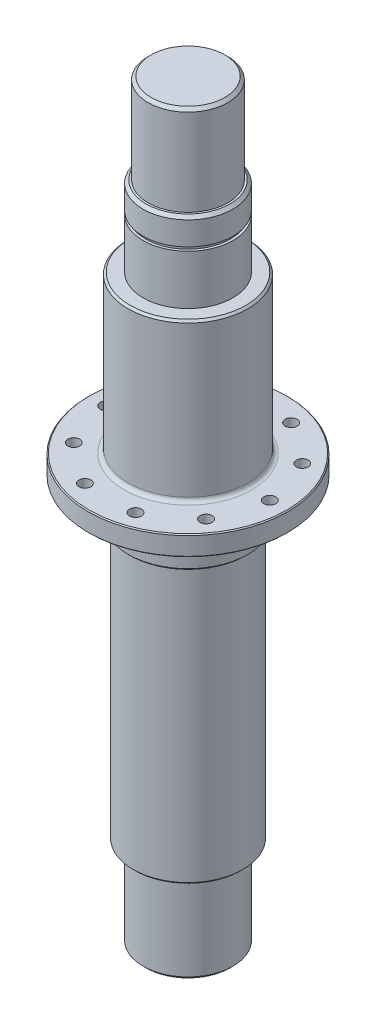
ISO-10303-21;
HEADER;
FILE_DESCRIPTION(('STEP AP214'),'2;1');
FILE_NAME('part.step','',(''),(''),'','','');
FILE_SCHEMA(('AUTOMOTIVE_DESIGN { 1 0 10303 214 1 1 1 1 }'));
ENDSEC;
DATA;
#1=APPLICATION_CONTEXT('core data for automotive mechanical design processes');
#2=APPLICATION_PROTOCOL_DEFINITION('international standard','automotive_design',2000,#1);
#3=PRODUCT_CONTEXT('',#1,'mechanical');
#4=PRODUCT('Part','Part','',(#3));
#5=PRODUCT_RELATED_PRODUCT_CATEGORY('part','',(#4));
#6=PRODUCT_DEFINITION_FORMATION('','',#4);
#7=PRODUCT_DEFINITION_CONTEXT('part definition',#1,'design');
#8=PRODUCT_DEFINITION('design','',#6,#7);
#9=PRODUCT_DEFINITION_SHAPE('','',#8);
#10=(LENGTH_UNIT() NAMED_UNIT(*) SI_UNIT(.MILLI.,.METRE.));
#11=(NAMED_UNIT(*) PLANE_ANGLE_UNIT() SI_UNIT($,.RADIAN.));
#12=(NAMED_UNIT(*) SI_UNIT($,.STERADIAN.) SOLID_ANGLE_UNIT());
#13=UNCERTAINTY_MEASURE_WITH_UNIT(LENGTH_MEASURE(1.E-05),#10,'distance_accuracy_value','');
#14=(GEOMETRIC_REPRESENTATION_CONTEXT(3) GLOBAL_UNCERTAINTY_ASSIGNED_CONTEXT((#13)) GLOBAL_UNIT_ASSIGNED_CONTEXT((#10,
#11,#12)) REPRESENTATION_CONTEXT('',''));
#15=CARTESIAN_POINT('',(0.,0.,0.));
#16=DIRECTION('',(0.,0.,1.));
#17=DIRECTION('',(1.,0.,0.));
#18=AXIS2_PLACEMENT_3D('',#15,#16,#17);
#19=CARTESIAN_POINT('',(0.,-158.,0.));
#20=DIRECTION('',(0.,-1.,0.));
#21=DIRECTION('',(0.,0.,-1.));
#22=AXIS2_PLACEMENT_3D('',#19,#20,#21);
#23=PLANE('',#22);
#24=CARTESIAN_POINT('',(0.,-158.,0.));
#25=DIRECTION('',(0.,-1.,0.));
#26=DIRECTION('',(0.,0.,-1.));
#27=AXIS2_PLACEMENT_3D('',#24,#25,#26);
#28=CIRCLE('',#27,23.5);
#29=CARTESIAN_POINT('',(0.,-158.,-23.5));
#30=VERTEX_POINT('',#29);
#31=EDGE_CURVE('E41',#30,#30,#28,.F.);
#32=ORIENTED_EDGE('',*,*,#31,.T.);
#33=EDGE_LOOP('',(#32));
#34=FACE_BOUND('',#33,.T.);
#35=CARTESIAN_POINT('',(0.,-158.,0.));
#36=DIRECTION('',(0.,-1.,0.));
#37=DIRECTION('',(0.,0.,-1.));
#38=AXIS2_PLACEMENT_3D('',#35,#36,#37);
#39=CIRCLE('',#38,26.5000000000001);
#40=CARTESIAN_POINT('',(0.,-158.,-26.5000000000001));
#41=VERTEX_POINT('',#40);
#42=EDGE_CURVE('E53',#41,#41,#39,.T.);
#43=ORIENTED_EDGE('',*,*,#42,.T.);
#44=EDGE_LOOP('',(#43));
#45=FACE_BOUND('',#44,.T.);
#46=ADVANCED_FACE('F30',(#34,#45),#23,.T.);
#47=CARTESIAN_POINT('',(0.,-20.,0.));
#48=DIRECTION('',(0.,-1.,0.));
#49=DIRECTION('',(0.,0.,-1.));
#50=AXIS2_PLACEMENT_3D('',#47,#48,#49);
#51=PLANE('',#50);
#52=CARTESIAN_POINT('',(0.,-20.,0.));
#53=DIRECTION('',(0.,-1.,0.));
#54=DIRECTION('',(0.,0.,-1.));
#55=AXIS2_PLACEMENT_3D('',#52,#53,#54);
#56=CIRCLE('',#55,28.5);
#57=CARTESIAN_POINT('',(0.,-20.,-28.5));
#58=VERTEX_POINT('',#57);
#59=EDGE_CURVE('E56',#58,#58,#56,.F.);
#60=ORIENTED_EDGE('',*,*,#59,.T.);
#61=EDGE_LOOP('',(#60));
#62=FACE_BOUND('',#61,.T.);
#63=CARTESIAN_POINT('',(0.,-20.,0.));
#64=DIRECTION('',(0.,-1.,0.));
#65=DIRECTION('',(0.,0.,-1.));
#66=AXIS2_PLACEMENT_3D('',#63,#64,#65);
#67=CIRCLE('',#66,29.);
#68=CARTESIAN_POINT('',(0.,-20.,-29.));
#69=VERTEX_POINT('',#68);
#70=EDGE_CURVE('E83',#69,#69,#67,.T.);
#71=ORIENTED_EDGE('',*,*,#70,.T.);
#72=EDGE_LOOP('',(#71));
#73=FACE_BOUND('',#72,.T.);
#74=ADVANCED_FACE('F204',(#62,#73),#51,.T.);
#75=CARTESIAN_POINT('',(0.,0.,0.));
#76=DIRECTION('',(0.,1.,0.));
#77=DIRECTION('',(0.,0.,1.));
#78=AXIS2_PLACEMENT_3D('',#75,#76,#77);
#79=PLANE('',#78);
#80=CARTESIAN_POINT('',(0.,0.,0.));
#81=DIRECTION('',(0.,1.,0.));
#82=DIRECTION('',(0.,0.,1.));
#83=AXIS2_PLACEMENT_3D('',#80,#81,#82);
#84=CIRCLE('',#83,49.5);
#85=CARTESIAN_POINT('',(0.,0.,49.5));
#86=VERTEX_POINT('',#85);
#87=EDGE_CURVE('E68',#86,#86,#84,.F.);
#88=ORIENTED_EDGE('',*,*,#87,.T.);
#89=EDGE_LOOP('',(#88));
#90=FACE_BOUND('',#89,.T.);
#91=CARTESIAN_POINT('',(0.,0.,0.));
#92=DIRECTION('',(0.,1.,0.));
#93=DIRECTION('',(0.,0.,1.));
#94=AXIS2_PLACEMENT_3D('',#91,#92,#93);
#95=CIRCLE('',#94,32.);
#96=CARTESIAN_POINT('',(0.,0.,32.));
#97=VERTEX_POINT('',#96);
#98=EDGE_CURVE('E74',#97,#97,#95,.T.);
#99=ORIENTED_EDGE('',*,*,#98,.T.);
#100=EDGE_LOOP('',(#99));
#101=FACE_BOUND('',#100,.T.);
#102=CARTESIAN_POINT('',(-33.1696967693727,0.,-24.0991953439915));
#103=DIRECTION('',(0.,1.,0.));
#104=DIRECTION('',(0.,0.,1.));
#105=AXIS2_PLACEMENT_3D('',#102,#103,#104);
#106=CIRCLE('',#105,3.);
#107=CARTESIAN_POINT('',(-33.1696967693727,0.,-21.0991953439915));
#108=VERTEX_POINT('',#107);
#109=EDGE_CURVE('E110',#108,#108,#106,.T.);
#110=ORIENTED_EDGE('',*,*,#109,.T.);
#111=EDGE_LOOP('',(#110));
#112=FACE_BOUND('',#111,.T.);
#113=CARTESIAN_POINT('',(-12.669696769373,0.,-38.9933171681013));
#114=DIRECTION('',(0.,1.,0.));
#115=DIRECTION('',(0.,0.,1.));
#116=AXIS2_PLACEMENT_3D('',#113,#114,#115);
#117=CIRCLE('',#116,3.);
#118=CARTESIAN_POINT('',(-12.669696769373,0.,-35.9933171681012));
#119=VERTEX_POINT('',#118);
#120=EDGE_CURVE('E114',#119,#119,#117,.T.);
#121=ORIENTED_EDGE('',*,*,#120,.T.);
#122=EDGE_LOOP('',(#121));
#123=FACE_BOUND('',#122,.T.);
#124=CARTESIAN_POINT('',(12.6696967693726,0.,-38.9933171681014));
#125=DIRECTION('',(0.,1.,0.));
#126=DIRECTION('',(0.,0.,1.));
#127=AXIS2_PLACEMENT_3D('',#124,#125,#126);
#128=CIRCLE('',#127,3.);
#129=CARTESIAN_POINT('',(12.6696967693726,0.,-35.9933171681014));
#130=VERTEX_POINT('',#129);
#131=EDGE_CURVE('E120',#130,#130,#128,.T.);
#132=ORIENTED_EDGE('',*,*,#131,.T.);
#133=EDGE_LOOP('',(#132));
#134=FACE_BOUND('',#133,.T.);
#135=CARTESIAN_POINT('',(-41.,0.,0.));
#136=DIRECTION('',(0.,1.,0.));
#137=DIRECTION('',(0.,0.,1.));
#138=AXIS2_PLACEMENT_3D('',#135,#136,#137);
#139=CIRCLE('',#138,3.);
#140=CARTESIAN_POINT('',(-41.,0.,3.));
#141=VERTEX_POINT('',#140);
#142=EDGE_CURVE('E126',#141,#141,#139,.T.);
#143=ORIENTED_EDGE('',*,*,#142,.T.);
#144=EDGE_LOOP('',(#143));
#145=FACE_BOUND('',#144,.T.);
#146=CARTESIAN_POINT('',(-33.169696769373,0.,24.0991953439912));
#147=DIRECTION('',(0.,1.,0.));
#148=DIRECTION('',(0.,0.,1.));
#149=AXIS2_PLACEMENT_3D('',#146,#147,#148);
#150=CIRCLE('',#149,3.);
#151=CARTESIAN_POINT('',(-33.169696769373,0.,27.0991953439912));
#152=VERTEX_POINT('',#151);
#153=EDGE_CURVE('E132',#152,#152,#150,.T.);
#154=ORIENTED_EDGE('',*,*,#153,.T.);
#155=EDGE_LOOP('',(#154));
#156=FACE_BOUND('',#155,.T.);
#157=CARTESIAN_POINT('',(-12.669696769373,0.,38.9933171681012));
#158=DIRECTION('',(0.,1.,0.));
#159=DIRECTION('',(0.,0.,1.));
#160=AXIS2_PLACEMENT_3D('',#157,#158,#159);
#161=CIRCLE('',#160,3.);
#162=CARTESIAN_POINT('',(-12.669696769373,0.,41.9933171681012));
#163=VERTEX_POINT('',#162);
#164=EDGE_CURVE('E138',#163,#163,#161,.T.);
#165=ORIENTED_EDGE('',*,*,#164,.T.);
#166=EDGE_LOOP('',(#165));
#167=FACE_BOUND('',#166,.T.);
#168=CARTESIAN_POINT('',(12.6696967693727,0.,38.9933171681013));
#169=DIRECTION('',(0.,1.,0.));
#170=DIRECTION('',(0.,0.,1.));
#171=AXIS2_PLACEMENT_3D('',#168,#169,#170);
#172=CIRCLE('',#171,3.);
#173=CARTESIAN_POINT('',(12.6696967693727,0.,41.9933171681013));
#174=VERTEX_POINT('',#173);
#175=EDGE_CURVE('E144',#174,#174,#172,.T.);
#176=ORIENTED_EDGE('',*,*,#175,.T.);
#177=EDGE_LOOP('',(#176));
#178=FACE_BOUND('',#177,.T.);
#179=CARTESIAN_POINT('',(33.1696967693728,0.,24.0991953439915));
#180=DIRECTION('',(0.,1.,0.));
#181=DIRECTION('',(0.,0.,1.));
#182=AXIS2_PLACEMENT_3D('',#179,#180,#181);
#183=CIRCLE('',#182,3.);
#184=CARTESIAN_POINT('',(33.1696967693728,0.,27.0991953439915));
#185=VERTEX_POINT('',#184);
#186=EDGE_CURVE('E150',#185,#185,#183,.T.);
#187=ORIENTED_EDGE('',*,*,#186,.T.);
#188=EDGE_LOOP('',(#187));
#189=FACE_BOUND('',#188,.T.);
#190=CARTESIAN_POINT('',(41.,0.,0.));
#191=DIRECTION('',(0.,1.,0.));
#192=DIRECTION('',(0.,0.,1.));
#193=AXIS2_PLACEMENT_3D('',#190,#191,#192);
#194=CIRCLE('',#193,3.);
#195=CARTESIAN_POINT('',(41.,0.,3.));
#196=VERTEX_POINT('',#195);
#197=EDGE_CURVE('E156',#196,#196,#194,.T.);
#198=ORIENTED_EDGE('',*,*,#197,.T.);
#199=EDGE_LOOP('',(#198));
#200=FACE_BOUND('',#199,.T.);
#201=CARTESIAN_POINT('',(33.1696967693727,0.,-24.0991953439916));
#202=DIRECTION('',(0.,1.,0.));
#203=DIRECTION('',(0.,0.,1.));
#204=AXIS2_PLACEMENT_3D('',#201,#202,#203);
#205=CIRCLE('',#204,3.);
#206=CARTESIAN_POINT('',(33.1696967693727,0.,-21.0991953439916));
#207=VERTEX_POINT('',#206);
#208=EDGE_CURVE('E162',#207,#207,#205,.T.);
#209=ORIENTED_EDGE('',*,*,#208,.T.);
#210=EDGE_LOOP('',(#209));
#211=FACE_BOUND('',#210,.T.);
#212=ADVANCED_FACE('F194',(#90,#101,#112,#123,#134,#145,#156,#167,#178,#189,#200,#211),#79,.F.);
#213=CARTESIAN_POINT('',(0.,128.6,0.));
#214=DIRECTION('',(0.,1.,0.));
#215=DIRECTION('',(0.,0.,1.));
#216=AXIS2_PLACEMENT_3D('',#213,#214,#215);
#217=PLANE('',#216);
#218=CARTESIAN_POINT('',(0.,128.6,0.));
#219=DIRECTION('',(0.,1.,0.));
#220=DIRECTION('',(0.,0.,1.));
#221=AXIS2_PLACEMENT_3D('',#218,#219,#220);
#222=CIRCLE('',#221,21.);
#223=CARTESIAN_POINT('',(0.,128.6,21.));
#224=VERTEX_POINT('',#223);
#225=EDGE_CURVE('E95',#224,#224,#222,.T.);
#226=ORIENTED_EDGE('',*,*,#225,.T.);
#227=EDGE_LOOP('',(#226));
#228=FACE_BOUND('',#227,.T.);
#229=CARTESIAN_POINT('',(0.,128.6,0.));
#230=DIRECTION('',(0.,1.,0.));
#231=DIRECTION('',(0.,0.,1.));
#232=AXIS2_PLACEMENT_3D('',#229,#230,#231);
#233=CIRCLE('',#232,20.);
#234=CARTESIAN_POINT('',(0.,128.6,20.));
#235=VERTEX_POINT('',#234);
#236=EDGE_CURVE('E185',#235,#235,#233,.T.);
#237=ORIENTED_EDGE('',*,*,#236,.F.);
#238=EDGE_LOOP('',(#237));
#239=FACE_BOUND('',#238,.T.);
#240=ADVANCED_FACE('F191',(#228,#239),#217,.T.);
#241=CARTESIAN_POINT('',(0.,113.5,0.));
#242=DIRECTION('',(0.,1.,0.));
#243=DIRECTION('',(0.,0.,1.));
#244=AXIS2_PLACEMENT_3D('',#241,#242,#243);
#245=PLANE('',#244);
#246=CARTESIAN_POINT('',(0.,113.5,0.));
#247=DIRECTION('',(0.,1.,0.));
#248=DIRECTION('',(0.,0.,1.));
#249=AXIS2_PLACEMENT_3D('',#246,#247,#248);
#250=CIRCLE('',#249,22.5);
#251=CARTESIAN_POINT('',(0.,113.5,22.5));
#252=VERTEX_POINT('',#251);
#253=EDGE_CURVE('E168',#252,#252,#250,.T.);
#254=ORIENTED_EDGE('',*,*,#253,.T.);
#255=EDGE_LOOP('',(#254));
#256=FACE_BOUND('',#255,.T.);
#257=CARTESIAN_POINT('',(0.,113.5,0.));
#258=DIRECTION('',(0.,1.,0.));
#259=DIRECTION('',(0.,0.,1.));
#260=AXIS2_PLACEMENT_3D('',#257,#258,#259);
#261=CIRCLE('',#260,21.25);
#262=CARTESIAN_POINT('',(0.,113.5,21.25));
#263=VERTEX_POINT('',#262);
#264=EDGE_CURVE('E177',#263,#263,#261,.T.);
#265=ORIENTED_EDGE('',*,*,#264,.F.);
#266=EDGE_LOOP('',(#265));
#267=FACE_BOUND('',#266,.T.);
#268=ADVANCED_FACE('F193',(#256,#267),#245,.T.);
#269=CARTESIAN_POINT('',(0.,88.6,0.));
#270=DIRECTION('',(0.,1.,0.));
#271=DIRECTION('',(0.,0.,1.));
#272=AXIS2_PLACEMENT_3D('',#269,#270,#271);
#273=PLANE('',#272);
#274=CARTESIAN_POINT('',(0.,88.6,0.));
#275=DIRECTION('',(0.,1.,0.));
#276=DIRECTION('',(0.,0.,1.));
#277=AXIS2_PLACEMENT_3D('',#274,#275,#276);
#278=CIRCLE('',#277,29.);
#279=CARTESIAN_POINT('',(0.,88.6,29.));
#280=VERTEX_POINT('',#279);
#281=EDGE_CURVE('E101',#280,#280,#278,.T.);
#282=ORIENTED_EDGE('',*,*,#281,.T.);
#283=EDGE_LOOP('',(#282));
#284=FACE_BOUND('',#283,.T.);
#285=CARTESIAN_POINT('',(0.,88.6,0.));
#286=DIRECTION('',(0.,1.,0.));
#287=DIRECTION('',(0.,0.,1.));
#288=AXIS2_PLACEMENT_3D('',#285,#286,#287);
#289=CIRCLE('',#288,22.5);
#290=CARTESIAN_POINT('',(0.,88.6,22.5));
#291=VERTEX_POINT('',#290);
#292=EDGE_CURVE('E171',#291,#291,#289,.T.);
#293=ORIENTED_EDGE('',*,*,#292,.F.);
#294=EDGE_LOOP('',(#293));
#295=FACE_BOUND('',#294,.T.);
#296=ADVANCED_FACE('F201',(#284,#295),#273,.T.);
#297=CARTESIAN_POINT('',(0.,10.,0.));
#298=DIRECTION('',(0.,1.,0.));
#299=DIRECTION('',(0.,0.,1.));
#300=AXIS2_PLACEMENT_3D('',#297,#298,#299);
#301=PLANE('',#300);
#302=CARTESIAN_POINT('',(0.,10.,0.));
#303=DIRECTION('',(0.,1.,0.));
#304=DIRECTION('',(0.,0.,1.));
#305=AXIS2_PLACEMENT_3D('',#302,#303,#304);
#306=CIRCLE('',#305,49.5);
#307=CARTESIAN_POINT('',(0.,10.,49.5));
#308=VERTEX_POINT('',#307);
#309=EDGE_CURVE('E65',#308,#308,#306,.T.);
#310=ORIENTED_EDGE('',*,*,#309,.T.);
#311=EDGE_LOOP('',(#310));
#312=FACE_BOUND('',#311,.T.);
#313=CARTESIAN_POINT('',(0.,10.,0.));
#314=DIRECTION('',(0.,1.,0.));
#315=DIRECTION('',(0.,0.,1.));
#316=AXIS2_PLACEMENT_3D('',#313,#314,#315);
#317=CIRCLE('',#316,32.);
#318=CARTESIAN_POINT('',(0.,10.,32.));
#319=VERTEX_POINT('',#318);
#320=EDGE_CURVE('E104',#319,#319,#317,.F.);
#321=ORIENTED_EDGE('',*,*,#320,.T.);
#322=EDGE_LOOP('',(#321));
#323=FACE_BOUND('',#322,.T.);
#324=CARTESIAN_POINT('',(-33.1696967693727,10.,-24.0991953439915));
#325=DIRECTION('',(0.,1.,0.));
#326=DIRECTION('',(0.,0.,1.));
#327=AXIS2_PLACEMENT_3D('',#324,#325,#326);
#328=CIRCLE('',#327,3.);
#329=CARTESIAN_POINT('',(-33.1696967693727,10.,-21.0991953439915));
#330=VERTEX_POINT('',#329);
#331=EDGE_CURVE('E111',#330,#330,#328,.T.);
#332=ORIENTED_EDGE('',*,*,#331,.F.);
#333=EDGE_LOOP('',(#332));
#334=FACE_BOUND('',#333,.T.);
#335=CARTESIAN_POINT('',(-12.669696769373,10.,-38.9933171681013));
#336=DIRECTION('',(0.,1.,0.));
#337=DIRECTION('',(0.,0.,1.));
#338=AXIS2_PLACEMENT_3D('',#335,#336,#337);
#339=CIRCLE('',#338,3.);
#340=CARTESIAN_POINT('',(-12.669696769373,10.,-35.9933171681012));
#341=VERTEX_POINT('',#340);
#342=EDGE_CURVE('E117',#341,#341,#339,.T.);
#343=ORIENTED_EDGE('',*,*,#342,.F.);
#344=EDGE_LOOP('',(#343));
#345=FACE_BOUND('',#344,.T.);
#346=CARTESIAN_POINT('',(12.6696967693726,10.,-38.9933171681014));
#347=DIRECTION('',(0.,1.,0.));
#348=DIRECTION('',(0.,0.,1.));
#349=AXIS2_PLACEMENT_3D('',#346,#347,#348);
#350=CIRCLE('',#349,3.);
#351=CARTESIAN_POINT('',(12.6696967693726,10.,-35.9933171681014));
#352=VERTEX_POINT('',#351);
#353=EDGE_CURVE('E123',#352,#352,#350,.T.);
#354=ORIENTED_EDGE('',*,*,#353,.F.);
#355=EDGE_LOOP('',(#354));
#356=FACE_BOUND('',#355,.T.);
#357=CARTESIAN_POINT('',(-41.,10.,0.));
#358=DIRECTION('',(0.,1.,0.));
#359=DIRECTION('',(0.,0.,1.));
#360=AXIS2_PLACEMENT_3D('',#357,#358,#359);
#361=CIRCLE('',#360,3.);
#362=CARTESIAN_POINT('',(-41.,10.,3.));
#363=VERTEX_POINT('',#362);
#364=EDGE_CURVE('E129',#363,#363,#361,.T.);
#365=ORIENTED_EDGE('',*,*,#364,.F.);
#366=EDGE_LOOP('',(#365));
#367=FACE_BOUND('',#366,.T.);
#368=CARTESIAN_POINT('',(-33.169696769373,10.,24.0991953439912));
#369=DIRECTION('',(0.,1.,0.));
#370=DIRECTION('',(0.,0.,1.));
#371=AXIS2_PLACEMENT_3D('',#368,#369,#370);
#372=CIRCLE('',#371,3.);
#373=CARTESIAN_POINT('',(-33.169696769373,10.,27.0991953439912));
#374=VERTEX_POINT('',#373);
#375=EDGE_CURVE('E135',#374,#374,#372,.T.);
#376=ORIENTED_EDGE('',*,*,#375,.F.);
#377=EDGE_LOOP('',(#376));
#378=FACE_BOUND('',#377,.T.);
#379=CARTESIAN_POINT('',(-12.669696769373,10.,38.9933171681012));
#380=DIRECTION('',(0.,1.,0.));
#381=DIRECTION('',(0.,0.,1.));
#382=AXIS2_PLACEMENT_3D('',#379,#380,#381);
#383=CIRCLE('',#382,3.);
#384=CARTESIAN_POINT('',(-12.669696769373,10.,41.9933171681012));
#385=VERTEX_POINT('',#384);
#386=EDGE_CURVE('E141',#385,#385,#383,.T.);
#387=ORIENTED_EDGE('',*,*,#386,.F.);
#388=EDGE_LOOP('',(#387));
#389=FACE_BOUND('',#388,.T.);
#390=CARTESIAN_POINT('',(12.6696967693727,10.,38.9933171681013));
#391=DIRECTION('',(0.,1.,0.));
#392=DIRECTION('',(0.,0.,1.));
#393=AXIS2_PLACEMENT_3D('',#390,#391,#392);
#394=CIRCLE('',#393,3.);
#395=CARTESIAN_POINT('',(12.6696967693727,10.,41.9933171681013));
#396=VERTEX_POINT('',#395);
#397=EDGE_CURVE('E147',#396,#396,#394,.T.);
#398=ORIENTED_EDGE('',*,*,#397,.F.);
#399=EDGE_LOOP('',(#398));
#400=FACE_BOUND('',#399,.T.);
#401=CARTESIAN_POINT('',(33.1696967693728,10.,24.0991953439915));
#402=DIRECTION('',(0.,1.,0.));
#403=DIRECTION('',(0.,0.,1.));
#404=AXIS2_PLACEMENT_3D('',#401,#402,#403);
#405=CIRCLE('',#404,3.);
#406=CARTESIAN_POINT('',(33.1696967693728,10.,27.0991953439915));
#407=VERTEX_POINT('',#406);
#408=EDGE_CURVE('E153',#407,#407,#405,.T.);
#409=ORIENTED_EDGE('',*,*,#408,.F.);
#410=EDGE_LOOP('',(#409));
#411=FACE_BOUND('',#410,.T.);
#412=CARTESIAN_POINT('',(41.,10.,0.));
#413=DIRECTION('',(0.,1.,0.));
#414=DIRECTION('',(0.,0.,1.));
#415=AXIS2_PLACEMENT_3D('',#412,#413,#414);
#416=CIRCLE('',#415,3.);
#417=CARTESIAN_POINT('',(41.,10.,3.));
#418=VERTEX_POINT('',#417);
#419=EDGE_CURVE('E159',#418,#418,#416,.T.);
#420=ORIENTED_EDGE('',*,*,#419,.F.);
#421=EDGE_LOOP('',(#420));
#422=FACE_BOUND('',#421,.T.);
#423=CARTESIAN_POINT('',(33.1696967693727,10.,-24.0991953439916));
#424=DIRECTION('',(0.,1.,0.));
#425=DIRECTION('',(0.,0.,1.));
#426=AXIS2_PLACEMENT_3D('',#423,#424,#425);
#427=CIRCLE('',#426,3.);
#428=CARTESIAN_POINT('',(33.1696967693727,10.,-21.0991953439916));
#429=VERTEX_POINT('',#428);
#430=EDGE_CURVE('E165',#429,#429,#427,.T.);
#431=ORIENTED_EDGE('',*,*,#430,.F.);
#432=EDGE_LOOP('',(#431));
#433=FACE_BOUND('',#432,.T.);
#434=ADVANCED_FACE('F438',(#312,#323,#334,#345,#356,#367,#378,#389,#400,#411,#422,#433),#301,.T.);
#435=CARTESIAN_POINT('',(0.,10.,0.));
#436=DIRECTION('',(0.,-1.,0.));
#437=DIRECTION('',(0.,0.,-1.));
#438=AXIS2_PLACEMENT_3D('',#435,#436,#437);
#439=CYLINDRICAL_SURFACE('',#438,50.);
#440=CARTESIAN_POINT('',(0.,9.50000000000002,0.));
#441=DIRECTION('',(0.,1.,0.));
#442=DIRECTION('',(0.,0.,1.));
#443=AXIS2_PLACEMENT_3D('',#440,#441,#442);
#444=CIRCLE('',#443,50.);
#445=CARTESIAN_POINT('',(0.,9.50000000000002,50.));
#446=VERTEX_POINT('',#445);
#447=EDGE_CURVE('E62',#446,#446,#444,.F.);
#448=ORIENTED_EDGE('',*,*,#447,.T.);
#449=EDGE_LOOP('',(#448));
#450=FACE_BOUND('',#449,.T.);
#451=CARTESIAN_POINT('',(0.,0.500000000000021,0.));
#452=DIRECTION('',(0.,1.,0.));
#453=DIRECTION('',(0.,0.,1.));
#454=AXIS2_PLACEMENT_3D('',#451,#452,#453);
#455=CIRCLE('',#454,50.);
#456=CARTESIAN_POINT('',(0.,0.500000000000021,50.));
#457=VERTEX_POINT('',#456);
#458=EDGE_CURVE('E71',#457,#457,#455,.T.);
#459=ORIENTED_EDGE('',*,*,#458,.T.);
#460=EDGE_LOOP('',(#459));
#461=FACE_BOUND('',#460,.T.);
#462=ADVANCED_FACE('F473',(#450,#461),#439,.T.);
#463=CARTESIAN_POINT('',(-33.1696967693727,0.,-24.0991953439915));
#464=DIRECTION('',(0.,1.,0.));
#465=DIRECTION('',(0.,0.,1.));
#466=AXIS2_PLACEMENT_3D('',#463,#464,#465);
#467=CYLINDRICAL_SURFACE('',#466,3.);
#468=ORIENTED_EDGE('',*,*,#109,.F.);
#469=EDGE_LOOP('',(#468));
#470=FACE_BOUND('',#469,.T.);
#471=ORIENTED_EDGE('',*,*,#331,.T.);
#472=EDGE_LOOP('',(#471));
#473=FACE_BOUND('',#472,.T.);
#474=ADVANCED_FACE('F553',(#470,#473),#467,.F.);
#475=CARTESIAN_POINT('',(-12.669696769373,0.,-38.9933171681013));
#476=DIRECTION('',(0.,1.,0.));
#477=DIRECTION('',(0.,0.,1.));
#478=AXIS2_PLACEMENT_3D('',#475,#476,#477);
#479=CYLINDRICAL_SURFACE('',#478,3.);
#480=ORIENTED_EDGE('',*,*,#120,.F.);
#481=EDGE_LOOP('',(#480));
#482=FACE_BOUND('',#481,.T.);
#483=ORIENTED_EDGE('',*,*,#342,.T.);
#484=EDGE_LOOP('',(#483));
#485=FACE_BOUND('',#484,.T.);
#486=ADVANCED_FACE('F544',(#482,#485),#479,.F.);
#487=CARTESIAN_POINT('',(12.6696967693726,0.,-38.9933171681014));
#488=DIRECTION('',(0.,1.,0.));
#489=DIRECTION('',(0.,0.,1.));
#490=AXIS2_PLACEMENT_3D('',#487,#488,#489);
#491=CYLINDRICAL_SURFACE('',#490,3.);
#492=ORIENTED_EDGE('',*,*,#131,.F.);
#493=EDGE_LOOP('',(#492));
#494=FACE_BOUND('',#493,.T.);
#495=ORIENTED_EDGE('',*,*,#353,.T.);
#496=EDGE_LOOP('',(#495));
#497=FACE_BOUND('',#496,.T.);
#498=ADVANCED_FACE('F535',(#494,#497),#491,.F.);
#499=CARTESIAN_POINT('',(-41.,0.,0.));
#500=DIRECTION('',(0.,1.,0.));
#501=DIRECTION('',(0.,0.,1.));
#502=AXIS2_PLACEMENT_3D('',#499,#500,#501);
#503=CYLINDRICAL_SURFACE('',#502,3.);
#504=ORIENTED_EDGE('',*,*,#142,.F.);
#505=EDGE_LOOP('',(#504));
#506=FACE_BOUND('',#505,.T.);
#507=ORIENTED_EDGE('',*,*,#364,.T.);
#508=EDGE_LOOP('',(#507));
#509=FACE_BOUND('',#508,.T.);
#510=ADVANCED_FACE('F526',(#506,#509),#503,.F.);
#511=CARTESIAN_POINT('',(-33.169696769373,0.,24.0991953439912));
#512=DIRECTION('',(0.,1.,0.));
#513=DIRECTION('',(0.,0.,1.));
#514=AXIS2_PLACEMENT_3D('',#511,#512,#513);
#515=CYLINDRICAL_SURFACE('',#514,3.);
#516=ORIENTED_EDGE('',*,*,#153,.F.);
#517=EDGE_LOOP('',(#516));
#518=FACE_BOUND('',#517,.T.);
#519=ORIENTED_EDGE('',*,*,#375,.T.);
#520=EDGE_LOOP('',(#519));
#521=FACE_BOUND('',#520,.T.);
#522=ADVANCED_FACE('F517',(#518,#521),#515,.F.);
#523=CARTESIAN_POINT('',(-12.669696769373,0.,38.9933171681012));
#524=DIRECTION('',(0.,1.,0.));
#525=DIRECTION('',(0.,0.,1.));
#526=AXIS2_PLACEMENT_3D('',#523,#524,#525);
#527=CYLINDRICAL_SURFACE('',#526,3.);
#528=ORIENTED_EDGE('',*,*,#164,.F.);
#529=EDGE_LOOP('',(#528));
#530=FACE_BOUND('',#529,.T.);
#531=ORIENTED_EDGE('',*,*,#386,.T.);
#532=EDGE_LOOP('',(#531));
#533=FACE_BOUND('',#532,.T.);
#534=ADVANCED_FACE('F508',(#530,#533),#527,.F.);
#535=CARTESIAN_POINT('',(12.6696967693727,0.,38.9933171681013));
#536=DIRECTION('',(0.,1.,0.));
#537=DIRECTION('',(0.,0.,1.));
#538=AXIS2_PLACEMENT_3D('',#535,#536,#537);
#539=CYLINDRICAL_SURFACE('',#538,3.);
#540=ORIENTED_EDGE('',*,*,#175,.F.);
#541=EDGE_LOOP('',(#540));
#542=FACE_BOUND('',#541,.T.);
#543=ORIENTED_EDGE('',*,*,#397,.T.);
#544=EDGE_LOOP('',(#543));
#545=FACE_BOUND('',#544,.T.);
#546=ADVANCED_FACE('F499',(#542,#545),#539,.F.);
#547=CARTESIAN_POINT('',(33.1696967693728,0.,24.0991953439915));
#548=DIRECTION('',(0.,1.,0.));
#549=DIRECTION('',(0.,0.,1.));
#550=AXIS2_PLACEMENT_3D('',#547,#548,#549);
#551=CYLINDRICAL_SURFACE('',#550,3.);
#552=ORIENTED_EDGE('',*,*,#186,.F.);
#553=EDGE_LOOP('',(#552));
#554=FACE_BOUND('',#553,.T.);
#555=ORIENTED_EDGE('',*,*,#408,.T.);
#556=EDGE_LOOP('',(#555));
#557=FACE_BOUND('',#556,.T.);
#558=ADVANCED_FACE('F490',(#554,#557),#551,.F.);
#559=CARTESIAN_POINT('',(41.,0.,0.));
#560=DIRECTION('',(0.,1.,0.));
#561=DIRECTION('',(0.,0.,1.));
#562=AXIS2_PLACEMENT_3D('',#559,#560,#561);
#563=CYLINDRICAL_SURFACE('',#562,3.);
#564=ORIENTED_EDGE('',*,*,#197,.F.);
#565=EDGE_LOOP('',(#564));
#566=FACE_BOUND('',#565,.T.);
#567=ORIENTED_EDGE('',*,*,#419,.T.);
#568=EDGE_LOOP('',(#567));
#569=FACE_BOUND('',#568,.T.);
#570=ADVANCED_FACE('F481',(#566,#569),#563,.F.);
#571=CARTESIAN_POINT('',(33.1696967693727,0.,-24.0991953439916));
#572=DIRECTION('',(0.,1.,0.));
#573=DIRECTION('',(0.,0.,1.));
#574=AXIS2_PLACEMENT_3D('',#571,#572,#573);
#575=CYLINDRICAL_SURFACE('',#574,3.);
#576=ORIENTED_EDGE('',*,*,#208,.F.);
#577=EDGE_LOOP('',(#576));
#578=FACE_BOUND('',#577,.T.);
#579=ORIENTED_EDGE('',*,*,#430,.T.);
#580=EDGE_LOOP('',(#579));
#581=FACE_BOUND('',#580,.T.);
#582=ADVANCED_FACE('F465',(#578,#581),#575,.F.);
#583=CARTESIAN_POINT('',(0.,88.6,0.));
#584=DIRECTION('',(0.,-1.,0.));
#585=DIRECTION('',(0.,0.,-1.));
#586=AXIS2_PLACEMENT_3D('',#583,#584,#585);
#587=CYLINDRICAL_SURFACE('',#586,30.);
#588=CARTESIAN_POINT('',(0.,87.6,0.));
#589=DIRECTION('',(0.,1.,0.));
#590=DIRECTION('',(0.,0.,1.));
#591=AXIS2_PLACEMENT_3D('',#588,#589,#590);
#592=CIRCLE('',#591,30.);
#593=CARTESIAN_POINT('',(0.,87.6,30.));
#594=VERTEX_POINT('',#593);
#595=EDGE_CURVE('E98',#594,#594,#592,.F.);
#596=ORIENTED_EDGE('',*,*,#595,.T.);
#597=EDGE_LOOP('',(#596));
#598=FACE_BOUND('',#597,.T.);
#599=CARTESIAN_POINT('',(0.,12.,0.));
#600=DIRECTION('',(0.,1.,0.));
#601=DIRECTION('',(0.,0.,1.));
#602=AXIS2_PLACEMENT_3D('',#599,#600,#601);
#603=CIRCLE('',#602,30.);
#604=CARTESIAN_POINT('',(0.,12.,30.));
#605=VERTEX_POINT('',#604);
#606=EDGE_CURVE('E107',#605,#605,#603,.T.);
#607=ORIENTED_EDGE('',*,*,#606,.T.);
#608=EDGE_LOOP('',(#607));
#609=FACE_BOUND('',#608,.T.);
#610=ADVANCED_FACE('F456',(#598,#609),#587,.T.);
#611=CARTESIAN_POINT('',(0.,12.,0.));
#612=DIRECTION('',(0.,1.,0.));
#613=DIRECTION('',(0.,0.,1.));
#614=AXIS2_PLACEMENT_3D('',#611,#612,#613);
#615=TOROIDAL_SURFACE('',#614,32.,2.);
#616=ORIENTED_EDGE('',*,*,#320,.F.);
#617=EDGE_LOOP('',(#616));
#618=FACE_BOUND('',#617,.T.);
#619=ORIENTED_EDGE('',*,*,#606,.F.);
#620=EDGE_LOOP('',(#619));
#621=FACE_BOUND('',#620,.T.);
#622=ADVANCED_FACE('F447',(#618,#621),#615,.F.);
#623=CARTESIAN_POINT('',(0.,88.6,0.));
#624=DIRECTION('',(0.,-1.,0.));
#625=DIRECTION('',(0.,0.,-1.));
#626=AXIS2_PLACEMENT_3D('',#623,#624,#625);
#627=CONICAL_SURFACE('',#626,29.,0.785398163397443);
#628=ORIENTED_EDGE('',*,*,#595,.F.);
#629=EDGE_LOOP('',(#628));
#630=FACE_BOUND('',#629,.T.);
#631=ORIENTED_EDGE('',*,*,#281,.F.);
#632=EDGE_LOOP('',(#631));
#633=FACE_BOUND('',#632,.T.);
#634=ADVANCED_FACE('F429',(#630,#633),#627,.T.);
#635=CARTESIAN_POINT('',(0.,113.5,0.));
#636=DIRECTION('',(0.,-1.,0.));
#637=DIRECTION('',(0.,0.,-1.));
#638=AXIS2_PLACEMENT_3D('',#635,#636,#637);
#639=CYLINDRICAL_SURFACE('',#638,22.5);
#640=ORIENTED_EDGE('',*,*,#253,.F.);
#641=EDGE_LOOP('',(#640));
#642=FACE_BOUND('',#641,.T.);
#643=ORIENTED_EDGE('',*,*,#292,.T.);
#644=EDGE_LOOP('',(#643));
#645=FACE_BOUND('',#644,.T.);
#646=ADVANCED_FACE('F415',(#642,#645),#639,.T.);
#647=CARTESIAN_POINT('',(0.,115.35,0.));
#648=DIRECTION('',(0.,-1.,0.));
#649=DIRECTION('',(0.,0.,-1.));
#650=AXIS2_PLACEMENT_3D('',#647,#648,#649);
#651=CYLINDRICAL_SURFACE('',#650,21.25);
#652=CARTESIAN_POINT('',(0.,115.35,0.));
#653=DIRECTION('',(0.,1.,0.));
#654=DIRECTION('',(0.,0.,1.));
#655=AXIS2_PLACEMENT_3D('',#652,#653,#654);
#656=CIRCLE('',#655,21.25);
#657=CARTESIAN_POINT('',(0.,115.35,21.25));
#658=VERTEX_POINT('',#657);
#659=EDGE_CURVE('E174',#658,#658,#656,.T.);
#660=ORIENTED_EDGE('',*,*,#659,.F.);
#661=EDGE_LOOP('',(#660));
#662=FACE_BOUND('',#661,.T.);
#663=ORIENTED_EDGE('',*,*,#264,.T.);
#664=EDGE_LOOP('',(#663));
#665=FACE_BOUND('',#664,.T.);
#666=ADVANCED_FACE('F407',(#662,#665),#651,.T.);
#667=CARTESIAN_POINT('',(0.,115.35,0.));
#668=DIRECTION('',(0.,1.,0.));
#669=DIRECTION('',(0.,0.,1.));
#670=AXIS2_PLACEMENT_3D('',#667,#668,#669);
#671=PLANE('',#670);
#672=CARTESIAN_POINT('',(0.,115.35,0.));
#673=DIRECTION('',(0.,1.,0.));
#674=DIRECTION('',(0.,0.,1.));
#675=AXIS2_PLACEMENT_3D('',#672,#673,#674);
#676=CIRCLE('',#675,22.5);
#677=CARTESIAN_POINT('',(0.,115.35,22.5));
#678=VERTEX_POINT('',#677);
#679=EDGE_CURVE('E180',#678,#678,#676,.T.);
#680=ORIENTED_EDGE('',*,*,#679,.F.);
#681=EDGE_LOOP('',(#680));
#682=FACE_BOUND('',#681,.T.);
#683=ORIENTED_EDGE('',*,*,#659,.T.);
#684=EDGE_LOOP('',(#683));
#685=FACE_BOUND('',#684,.T.);
#686=ADVANCED_FACE('F398',(#682,#685),#671,.F.);
#687=CARTESIAN_POINT('',(0.,128.6,0.));
#688=DIRECTION('',(0.,-1.,0.));
#689=DIRECTION('',(0.,0.,-1.));
#690=AXIS2_PLACEMENT_3D('',#687,#688,#689);
#691=CYLINDRICAL_SURFACE('',#690,22.5);
#692=CARTESIAN_POINT('',(0.,127.1,0.));
#693=DIRECTION('',(0.,1.,0.));
#694=DIRECTION('',(0.,0.,1.));
#695=AXIS2_PLACEMENT_3D('',#692,#693,#694);
#696=CIRCLE('',#695,22.5);
#697=CARTESIAN_POINT('',(0.,127.1,22.5));
#698=VERTEX_POINT('',#697);
#699=EDGE_CURVE('E92',#698,#698,#696,.F.);
#700=ORIENTED_EDGE('',*,*,#699,.T.);
#701=EDGE_LOOP('',(#700));
#702=FACE_BOUND('',#701,.T.);
#703=ORIENTED_EDGE('',*,*,#679,.T.);
#704=EDGE_LOOP('',(#703));
#705=FACE_BOUND('',#704,.T.);
#706=ADVANCED_FACE('F242',(#702,#705),#691,.T.);
#707=CARTESIAN_POINT('',(0.,128.6,0.));
#708=DIRECTION('',(0.,-1.,0.));
#709=DIRECTION('',(0.,0.,-1.));
#710=AXIS2_PLACEMENT_3D('',#707,#708,#709);
#711=CONICAL_SURFACE('',#710,21.,0.785398163397444);
#712=ORIENTED_EDGE('',*,*,#699,.F.);
#713=EDGE_LOOP('',(#712));
#714=FACE_BOUND('',#713,.T.);
#715=ORIENTED_EDGE('',*,*,#225,.F.);
#716=EDGE_LOOP('',(#715));
#717=FACE_BOUND('',#716,.T.);
#718=ADVANCED_FACE('F237',(#714,#717),#711,.T.);
#719=CARTESIAN_POINT('',(0.,173.6,0.));
#720=DIRECTION('',(0.,-1.,0.));
#721=DIRECTION('',(0.,0.,-1.));
#722=AXIS2_PLACEMENT_3D('',#719,#720,#721);
#723=CYLINDRICAL_SURFACE('',#722,20.);
#724=CARTESIAN_POINT('',(0.,172.1,0.));
#725=DIRECTION('',(0.,1.,0.));
#726=DIRECTION('',(0.,0.,1.));
#727=AXIS2_PLACEMENT_3D('',#724,#725,#726);
#728=CIRCLE('',#727,20.);
#729=CARTESIAN_POINT('',(0.,172.1,20.));
#730=VERTEX_POINT('',#729);
#731=EDGE_CURVE('E86',#730,#730,#728,.F.);
#732=ORIENTED_EDGE('',*,*,#731,.T.);
#733=EDGE_LOOP('',(#732));
#734=FACE_BOUND('',#733,.T.);
#735=ORIENTED_EDGE('',*,*,#236,.T.);
#736=EDGE_LOOP('',(#735));
#737=FACE_BOUND('',#736,.T.);
#738=ADVANCED_FACE('F189',(#734,#737),#723,.T.);
#739=CARTESIAN_POINT('',(0.,173.6,0.));
#740=DIRECTION('',(0.,1.,0.));
#741=DIRECTION('',(0.,0.,1.));
#742=AXIS2_PLACEMENT_3D('',#739,#740,#741);
#743=PLANE('',#742);
#744=CARTESIAN_POINT('',(0.,173.6,0.));
#745=DIRECTION('',(0.,1.,0.));
#746=DIRECTION('',(0.,0.,1.));
#747=AXIS2_PLACEMENT_3D('',#744,#745,#746);
#748=CIRCLE('',#747,18.5000000000001);
#749=CARTESIAN_POINT('',(0.,173.6,18.5000000000001));
#750=VERTEX_POINT('',#749);
#751=EDGE_CURVE('E89',#750,#750,#748,.T.);
#752=ORIENTED_EDGE('',*,*,#751,.T.);
#753=EDGE_LOOP('',(#752));
#754=FACE_BOUND('',#753,.T.);
#755=ADVANCED_FACE('F233',(#754),#743,.T.);
#756=CARTESIAN_POINT('',(0.,173.6,0.));
#757=DIRECTION('',(0.,-1.,0.));
#758=DIRECTION('',(0.,0.,-1.));
#759=AXIS2_PLACEMENT_3D('',#756,#757,#758);
#760=CONICAL_SURFACE('',#759,18.5000000000001,0.785398163397453);
#761=ORIENTED_EDGE('',*,*,#731,.F.);
#762=EDGE_LOOP('',(#761));
#763=FACE_BOUND('',#762,.T.);
#764=ORIENTED_EDGE('',*,*,#751,.F.);
#765=EDGE_LOOP('',(#764));
#766=FACE_BOUND('',#765,.T.);
#767=ADVANCED_FACE('F231',(#763,#766),#760,.T.);
#768=CARTESIAN_POINT('',(0.,-20.,0.));
#769=DIRECTION('',(0.,1.,0.));
#770=DIRECTION('',(0.,0.,1.));
#771=AXIS2_PLACEMENT_3D('',#768,#769,#770);
#772=CYLINDRICAL_SURFACE('',#771,30.);
#773=CARTESIAN_POINT('',(0.,-2.,0.));
#774=DIRECTION('',(0.,1.,0.));
#775=DIRECTION('',(0.,0.,1.));
#776=AXIS2_PLACEMENT_3D('',#773,#774,#775);
#777=CIRCLE('',#776,30.);
#778=CARTESIAN_POINT('',(0.,-2.,30.));
#779=VERTEX_POINT('',#778);
#780=EDGE_CURVE('E77',#779,#779,#777,.F.);
#781=ORIENTED_EDGE('',*,*,#780,.T.);
#782=EDGE_LOOP('',(#781));
#783=FACE_BOUND('',#782,.T.);
#784=CARTESIAN_POINT('',(0.,-19.,0.));
#785=DIRECTION('',(0.,-1.,0.));
#786=DIRECTION('',(0.,0.,-1.));
#787=AXIS2_PLACEMENT_3D('',#784,#785,#786);
#788=CIRCLE('',#787,30.);
#789=CARTESIAN_POINT('',(0.,-19.,-30.));
#790=VERTEX_POINT('',#789);
#791=EDGE_CURVE('E80',#790,#790,#788,.F.);
#792=ORIENTED_EDGE('',*,*,#791,.T.);
#793=EDGE_LOOP('',(#792));
#794=FACE_BOUND('',#793,.T.);
#795=ADVANCED_FACE('F227',(#783,#794),#772,.T.);
#796=CARTESIAN_POINT('',(0.,-20.,0.));
#797=DIRECTION('',(0.,1.,0.));
#798=DIRECTION('',(0.,0.,1.));
#799=AXIS2_PLACEMENT_3D('',#796,#797,#798);
#800=CONICAL_SURFACE('',#799,29.,0.78539816339744);
#801=ORIENTED_EDGE('',*,*,#791,.F.);
#802=EDGE_LOOP('',(#801));
#803=FACE_BOUND('',#802,.T.);
#804=ORIENTED_EDGE('',*,*,#70,.F.);
#805=EDGE_LOOP('',(#804));
#806=FACE_BOUND('',#805,.T.);
#807=ADVANCED_FACE('F230',(#803,#806),#800,.T.);
#808=CARTESIAN_POINT('',(0.,-2.,0.));
#809=DIRECTION('',(0.,1.,0.));
#810=DIRECTION('',(0.,0.,1.));
#811=AXIS2_PLACEMENT_3D('',#808,#809,#810);
#812=TOROIDAL_SURFACE('',#811,32.,2.);
#813=ORIENTED_EDGE('',*,*,#98,.F.);
#814=EDGE_LOOP('',(#813));
#815=FACE_BOUND('',#814,.T.);
#816=ORIENTED_EDGE('',*,*,#780,.F.);
#817=EDGE_LOOP('',(#816));
#818=FACE_BOUND('',#817,.T.);
#819=ADVANCED_FACE('F257',(#815,#818),#812,.F.);
#820=CARTESIAN_POINT('',(0.,0.500000000000021,0.));
#821=DIRECTION('',(0.,1.,0.));
#822=DIRECTION('',(0.,0.,1.));
#823=AXIS2_PLACEMENT_3D('',#820,#821,#822);
#824=CONICAL_SURFACE('',#823,50.,0.785398163397441);
#825=ORIENTED_EDGE('',*,*,#87,.F.);
#826=EDGE_LOOP('',(#825));
#827=FACE_BOUND('',#826,.T.);
#828=ORIENTED_EDGE('',*,*,#458,.F.);
#829=EDGE_LOOP('',(#828));
#830=FACE_BOUND('',#829,.T.);
#831=ADVANCED_FACE('F261',(#827,#830),#824,.T.);
#832=CARTESIAN_POINT('',(0.,10.,0.));
#833=DIRECTION('',(0.,-1.,0.));
#834=DIRECTION('',(0.,0.,-1.));
#835=AXIS2_PLACEMENT_3D('',#832,#833,#834);
#836=CONICAL_SURFACE('',#835,49.5,0.785398163397455);
#837=ORIENTED_EDGE('',*,*,#447,.F.);
#838=EDGE_LOOP('',(#837));
#839=FACE_BOUND('',#838,.T.);
#840=ORIENTED_EDGE('',*,*,#309,.F.);
#841=EDGE_LOOP('',(#840));
#842=FACE_BOUND('',#841,.T.);
#843=ADVANCED_FACE('F224',(#839,#842),#836,.T.);
#844=CARTESIAN_POINT('',(0.,-158.,0.));
#845=DIRECTION('',(0.,1.,0.));
#846=DIRECTION('',(0.,0.,1.));
#847=AXIS2_PLACEMENT_3D('',#844,#845,#846);
#848=CYLINDRICAL_SURFACE('',#847,27.5);
#849=CARTESIAN_POINT('',(0.,-157.,0.));
#850=DIRECTION('',(0.,-1.,0.));
#851=DIRECTION('',(0.,0.,-1.));
#852=AXIS2_PLACEMENT_3D('',#849,#850,#851);
#853=CIRCLE('',#852,27.5);
#854=CARTESIAN_POINT('',(0.,-157.,-27.5));
#855=VERTEX_POINT('',#854);
#856=EDGE_CURVE('E50',#855,#855,#853,.F.);
#857=ORIENTED_EDGE('',*,*,#856,.T.);
#858=EDGE_LOOP('',(#857));
#859=FACE_BOUND('',#858,.T.);
#860=CARTESIAN_POINT('',(0.,-21.,0.));
#861=DIRECTION('',(0.,-1.,0.));
#862=DIRECTION('',(0.,0.,-1.));
#863=AXIS2_PLACEMENT_3D('',#860,#861,#862);
#864=CIRCLE('',#863,27.5);
#865=CARTESIAN_POINT('',(0.,-21.,-27.5));
#866=VERTEX_POINT('',#865);
#867=EDGE_CURVE('E59',#866,#866,#864,.T.);
#868=ORIENTED_EDGE('',*,*,#867,.T.);
#869=EDGE_LOOP('',(#868));
#870=FACE_BOUND('',#869,.T.);
#871=ADVANCED_FACE('F222',(#859,#870),#848,.T.);
#872=CARTESIAN_POINT('',(0.,-203.,0.));
#873=DIRECTION('',(0.,1.,0.));
#874=DIRECTION('',(0.,0.,1.));
#875=AXIS2_PLACEMENT_3D('',#872,#873,#874);
#876=CYLINDRICAL_SURFACE('',#875,22.5);
#877=CARTESIAN_POINT('',(0.,-201.5,0.));
#878=DIRECTION('',(0.,-1.,0.));
#879=DIRECTION('',(0.,0.,-1.));
#880=AXIS2_PLACEMENT_3D('',#877,#878,#879);
#881=CIRCLE('',#880,22.5);
#882=CARTESIAN_POINT('',(0.,-201.5,-22.5));
#883=VERTEX_POINT('',#882);
#884=EDGE_CURVE('E10',#883,#883,#881,.F.);
#885=ORIENTED_EDGE('',*,*,#884,.T.);
#886=EDGE_LOOP('',(#885));
#887=FACE_BOUND('',#886,.T.);
#888=CARTESIAN_POINT('',(0.,-159.,0.));
#889=DIRECTION('',(0.,-1.,0.));
#890=DIRECTION('',(0.,0.,-1.));
#891=AXIS2_PLACEMENT_3D('',#888,#889,#890);
#892=CIRCLE('',#891,22.5);
#893=CARTESIAN_POINT('',(0.,-159.,-22.5));
#894=VERTEX_POINT('',#893);
#895=EDGE_CURVE('E45',#894,#894,#892,.T.);
#896=ORIENTED_EDGE('',*,*,#895,.T.);
#897=EDGE_LOOP('',(#896));
#898=FACE_BOUND('',#897,.T.);
#899=ADVANCED_FACE('F220',(#887,#898),#876,.T.);
#900=CARTESIAN_POINT('',(0.,-203.,0.));
#901=DIRECTION('',(0.,-1.,0.));
#902=DIRECTION('',(0.,0.,-1.));
#903=AXIS2_PLACEMENT_3D('',#900,#901,#902);
#904=PLANE('',#903);
#905=CARTESIAN_POINT('',(0.,-203.,0.));
#906=DIRECTION('',(0.,-1.,0.));
#907=DIRECTION('',(0.,0.,-1.));
#908=AXIS2_PLACEMENT_3D('',#905,#906,#907);
#909=CIRCLE('',#908,21.0000000000003);
#910=CARTESIAN_POINT('',(0.,-203.,-21.0000000000003));
#911=VERTEX_POINT('',#910);
#912=EDGE_CURVE('E37',#911,#911,#909,.T.);
#913=ORIENTED_EDGE('',*,*,#912,.T.);
#914=EDGE_LOOP('',(#913));
#915=FACE_BOUND('',#914,.T.);
#916=ADVANCED_FACE('F273',(#915),#904,.T.);
#917=CARTESIAN_POINT('',(0.,-21.,0.));
#918=DIRECTION('',(0.,-1.,0.));
#919=DIRECTION('',(0.,0.,-1.));
#920=AXIS2_PLACEMENT_3D('',#917,#918,#919);
#921=TOROIDAL_SURFACE('',#920,28.5,1.);
#922=ORIENTED_EDGE('',*,*,#59,.F.);
#923=EDGE_LOOP('',(#922));
#924=FACE_BOUND('',#923,.T.);
#925=ORIENTED_EDGE('',*,*,#867,.F.);
#926=EDGE_LOOP('',(#925));
#927=FACE_BOUND('',#926,.T.);
#928=ADVANCED_FACE('F269',(#924,#927),#921,.F.);
#929=CARTESIAN_POINT('',(0.,-158.,0.));
#930=DIRECTION('',(0.,1.,0.));
#931=DIRECTION('',(0.,0.,1.));
#932=AXIS2_PLACEMENT_3D('',#929,#930,#931);
#933=CONICAL_SURFACE('',#932,26.5000000000001,0.785398163397422);
#934=ORIENTED_EDGE('',*,*,#856,.F.);
#935=EDGE_LOOP('',(#934));
#936=FACE_BOUND('',#935,.T.);
#937=ORIENTED_EDGE('',*,*,#42,.F.);
#938=EDGE_LOOP('',(#937));
#939=FACE_BOUND('',#938,.T.);
#940=ADVANCED_FACE('F272',(#936,#939),#933,.T.);
#941=CARTESIAN_POINT('',(0.,-159.,0.));
#942=DIRECTION('',(0.,-1.,0.));
#943=DIRECTION('',(0.,0.,-1.));
#944=AXIS2_PLACEMENT_3D('',#941,#942,#943);
#945=TOROIDAL_SURFACE('',#944,23.5,1.);
#946=ORIENTED_EDGE('',*,*,#31,.F.);
#947=EDGE_LOOP('',(#946));
#948=FACE_BOUND('',#947,.T.);
#949=ORIENTED_EDGE('',*,*,#895,.F.);
#950=EDGE_LOOP('',(#949));
#951=FACE_BOUND('',#950,.T.);
#952=ADVANCED_FACE('F276',(#948,#951),#945,.F.);
#953=CARTESIAN_POINT('',(0.,-203.,0.));
#954=DIRECTION('',(0.,1.,0.));
#955=DIRECTION('',(0.,0.,1.));
#956=AXIS2_PLACEMENT_3D('',#953,#954,#955);
#957=CONICAL_SURFACE('',#956,21.0000000000003,0.785398163397444);
#958=ORIENTED_EDGE('',*,*,#884,.F.);
#959=EDGE_LOOP('',(#958));
#960=FACE_BOUND('',#959,.T.);
#961=ORIENTED_EDGE('',*,*,#912,.F.);
#962=EDGE_LOOP('',(#961));
#963=FACE_BOUND('',#962,.T.);
#964=ADVANCED_FACE('F32',(#960,#963),#957,.T.);
#965=CLOSED_SHELL('',(#46,#74,#212,#240,#268,#296,#434,#462,#474,#486,#498,#510,#522,#534,#546,
#558,#570,#582,#610,#622,#634,#646,#666,#686,#706,#718,#738,#755,#767,#795,#807,#819,#831,#843,
#871,#899,#916,#928,#940,#952,#964));
#966=MANIFOLD_SOLID_BREP('B2',#965);
#967=ADVANCED_BREP_SHAPE_REPRESENTATION('',(#18,#966),#14);
#968=SHAPE_DEFINITION_REPRESENTATION(#9,#967);
ENDSEC;
END-ISO-10303-21;
